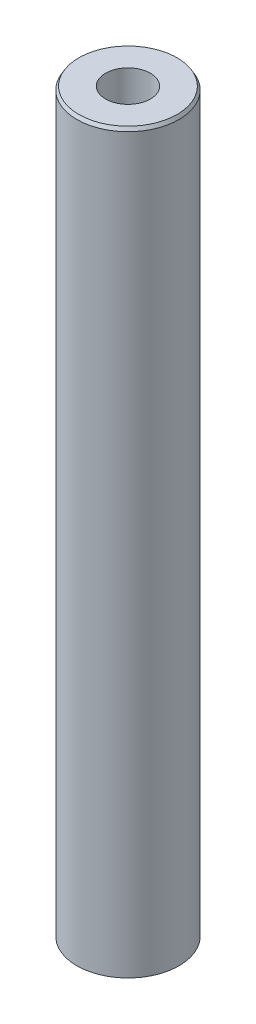
ISO-10303-21;
HEADER;
FILE_DESCRIPTION(('STEP AP214'),'2;1');
FILE_NAME('part.step','',(''),(''),'','','');
FILE_SCHEMA(('AUTOMOTIVE_DESIGN { 1 0 10303 214 1 1 1 1 }'));
ENDSEC;
DATA;
#1=APPLICATION_CONTEXT('core data for automotive mechanical design processes');
#2=APPLICATION_PROTOCOL_DEFINITION('international standard','automotive_design',2000,#1);
#3=PRODUCT_CONTEXT('',#1,'mechanical');
#4=PRODUCT('Part','Part','',(#3));
#5=PRODUCT_RELATED_PRODUCT_CATEGORY('part','',(#4));
#6=PRODUCT_DEFINITION_FORMATION('','',#4);
#7=PRODUCT_DEFINITION_CONTEXT('part definition',#1,'design');
#8=PRODUCT_DEFINITION('design','',#6,#7);
#9=PRODUCT_DEFINITION_SHAPE('','',#8);
#10=(LENGTH_UNIT() NAMED_UNIT(*) SI_UNIT(.MILLI.,.METRE.));
#11=(NAMED_UNIT(*) PLANE_ANGLE_UNIT() SI_UNIT($,.RADIAN.));
#12=(NAMED_UNIT(*) SI_UNIT($,.STERADIAN.) SOLID_ANGLE_UNIT());
#13=UNCERTAINTY_MEASURE_WITH_UNIT(LENGTH_MEASURE(1.E-05),#10,'distance_accuracy_value','');
#14=(GEOMETRIC_REPRESENTATION_CONTEXT(3) GLOBAL_UNCERTAINTY_ASSIGNED_CONTEXT((#13)) GLOBAL_UNIT_ASSIGNED_CONTEXT((#10,
#11,#12)) REPRESENTATION_CONTEXT('',''));
#15=CARTESIAN_POINT('',(0.,0.,0.));
#16=DIRECTION('',(0.,0.,1.));
#17=DIRECTION('',(1.,0.,0.));
#18=AXIS2_PLACEMENT_3D('',#15,#16,#17);
#19=CARTESIAN_POINT('',(0.,505.789465377228,0.));
#20=DIRECTION('',(0.,-1.,0.));
#21=DIRECTION('',(0.,0.,-1.));
#22=AXIS2_PLACEMENT_3D('',#19,#20,#21);
#23=CYLINDRICAL_SURFACE('',#22,35.);
#24=CARTESIAN_POINT('',(0.,503.458991652719,0.));
#25=DIRECTION('',(0.,1.,0.));
#26=DIRECTION('',(0.,0.,1.));
#27=AXIS2_PLACEMENT_3D('',#24,#25,#26);
#28=CIRCLE('',#27,35.);
#29=CARTESIAN_POINT('',(0.,503.458991652719,35.));
#30=VERTEX_POINT('',#29);
#31=EDGE_CURVE('E50',#30,#30,#28,.F.);
#32=ORIENTED_EDGE('',*,*,#31,.T.);
#33=EDGE_LOOP('',(#32));
#34=FACE_BOUND('',#33,.T.);
#35=CARTESIAN_POINT('',(0.,1.34549963218455,0.));
#36=DIRECTION('',(0.,1.,0.));
#37=DIRECTION('',(0.,0.,1.));
#38=AXIS2_PLACEMENT_3D('',#35,#36,#37);
#39=CIRCLE('',#38,35.);
#40=CARTESIAN_POINT('',(0.,1.34549963218455,35.));
#41=VERTEX_POINT('',#40);
#42=EDGE_CURVE('E51',#41,#41,#39,.T.);
#43=ORIENTED_EDGE('',*,*,#42,.T.);
#44=EDGE_LOOP('',(#43));
#45=FACE_BOUND('',#44,.T.);
#46=ADVANCED_FACE('F39',(#34,#45),#23,.T.);
#47=CARTESIAN_POINT('',(0.,505.789465377228,0.));
#48=DIRECTION('',(0.,1.,0.));
#49=DIRECTION('',(0.,0.,1.));
#50=AXIS2_PLACEMENT_3D('',#47,#48,#49);
#51=PLANE('',#50);
#52=CARTESIAN_POINT('',(0.,505.789465377228,0.));
#53=DIRECTION('',(0.,1.,0.));
#54=DIRECTION('',(0.,0.,1.));
#55=AXIS2_PLACEMENT_3D('',#52,#53,#54);
#56=CIRCLE('',#55,33.6545003678153);
#57=CARTESIAN_POINT('',(0.,505.789465377228,33.6545003678153));
#58=VERTEX_POINT('',#57);
#59=EDGE_CURVE('E54',#58,#58,#56,.T.);
#60=ORIENTED_EDGE('',*,*,#59,.T.);
#61=EDGE_LOOP('',(#60));
#62=FACE_BOUND('',#61,.T.);
#63=CARTESIAN_POINT('',(0.,505.789465377228,0.));
#64=DIRECTION('',(0.,1.,0.));
#65=DIRECTION('',(0.,0.,1.));
#66=AXIS2_PLACEMENT_3D('',#63,#64,#65);
#67=CIRCLE('',#66,15.3492775970713);
#68=CARTESIAN_POINT('',(0.,505.789465377228,15.3492775970713));
#69=VERTEX_POINT('',#68);
#70=EDGE_CURVE('E58',#69,#69,#67,.T.);
#71=ORIENTED_EDGE('',*,*,#70,.F.);
#72=EDGE_LOOP('',(#71));
#73=FACE_BOUND('',#72,.T.);
#74=ADVANCED_FACE('F69',(#62,#73),#51,.T.);
#75=CARTESIAN_POINT('',(0.,0.,0.));
#76=DIRECTION('',(0.,1.,0.));
#77=DIRECTION('',(0.,0.,1.));
#78=AXIS2_PLACEMENT_3D('',#75,#76,#77);
#79=PLANE('',#78);
#80=CARTESIAN_POINT('',(0.,0.,0.));
#81=DIRECTION('',(0.,1.,0.));
#82=DIRECTION('',(0.,0.,1.));
#83=AXIS2_PLACEMENT_3D('',#80,#81,#82);
#84=CIRCLE('',#83,32.669526275491);
#85=CARTESIAN_POINT('',(0.,0.,32.669526275491));
#86=VERTEX_POINT('',#85);
#87=EDGE_CURVE('E10',#86,#86,#84,.F.);
#88=ORIENTED_EDGE('',*,*,#87,.T.);
#89=EDGE_LOOP('',(#88));
#90=FACE_BOUND('',#89,.T.);
#91=CARTESIAN_POINT('',(0.,0.,0.));
#92=DIRECTION('',(0.,1.,0.));
#93=DIRECTION('',(0.,0.,1.));
#94=AXIS2_PLACEMENT_3D('',#91,#92,#93);
#95=CIRCLE('',#94,15.3492775970713);
#96=CARTESIAN_POINT('',(0.,0.,15.3492775970713));
#97=VERTEX_POINT('',#96);
#98=EDGE_CURVE('E63',#97,#97,#95,.T.);
#99=ORIENTED_EDGE('',*,*,#98,.T.);
#100=EDGE_LOOP('',(#99));
#101=FACE_BOUND('',#100,.T.);
#102=ADVANCED_FACE('F75',(#90,#101),#79,.F.);
#103=CARTESIAN_POINT('',(0.,505.789465377228,0.));
#104=DIRECTION('',(0.,-1.,0.));
#105=DIRECTION('',(0.,0.,-1.));
#106=AXIS2_PLACEMENT_3D('',#103,#104,#105);
#107=CYLINDRICAL_SURFACE('',#106,15.3492775970713);
#108=ORIENTED_EDGE('',*,*,#70,.T.);
#109=EDGE_LOOP('',(#108));
#110=FACE_BOUND('',#109,.T.);
#111=ORIENTED_EDGE('',*,*,#98,.F.);
#112=EDGE_LOOP('',(#111));
#113=FACE_BOUND('',#112,.T.);
#114=ADVANCED_FACE('F70',(#110,#113),#107,.F.);
#115=CARTESIAN_POINT('',(0.,505.789465377228,0.));
#116=DIRECTION('',(0.,-1.,0.));
#117=DIRECTION('',(0.,0.,-1.));
#118=AXIS2_PLACEMENT_3D('',#115,#116,#117);
#119=CONICAL_SURFACE('',#118,33.6545003678153,0.523598775598323);
#120=ORIENTED_EDGE('',*,*,#31,.F.);
#121=EDGE_LOOP('',(#120));
#122=FACE_BOUND('',#121,.T.);
#123=ORIENTED_EDGE('',*,*,#59,.F.);
#124=EDGE_LOOP('',(#123));
#125=FACE_BOUND('',#124,.T.);
#126=ADVANCED_FACE('F81',(#122,#125),#119,.T.);
#127=CARTESIAN_POINT('',(0.,1.34549963218455,0.));
#128=DIRECTION('',(0.,1.,0.));
#129=DIRECTION('',(0.,0.,1.));
#130=AXIS2_PLACEMENT_3D('',#127,#128,#129);
#131=CONICAL_SURFACE('',#130,35.,1.04719755119662);
#132=ORIENTED_EDGE('',*,*,#87,.F.);
#133=EDGE_LOOP('',(#132));
#134=FACE_BOUND('',#133,.T.);
#135=ORIENTED_EDGE('',*,*,#42,.F.);
#136=EDGE_LOOP('',(#135));
#137=FACE_BOUND('',#136,.T.);
#138=ADVANCED_FACE('F45',(#134,#137),#131,.T.);
#139=CLOSED_SHELL('',(#46,#74,#102,#114,#126,#138));
#140=MANIFOLD_SOLID_BREP('B2',#139);
#141=ADVANCED_BREP_SHAPE_REPRESENTATION('',(#18,#140),#14);
#142=SHAPE_DEFINITION_REPRESENTATION(#9,#141);
ENDSEC;
END-ISO-10303-21;
